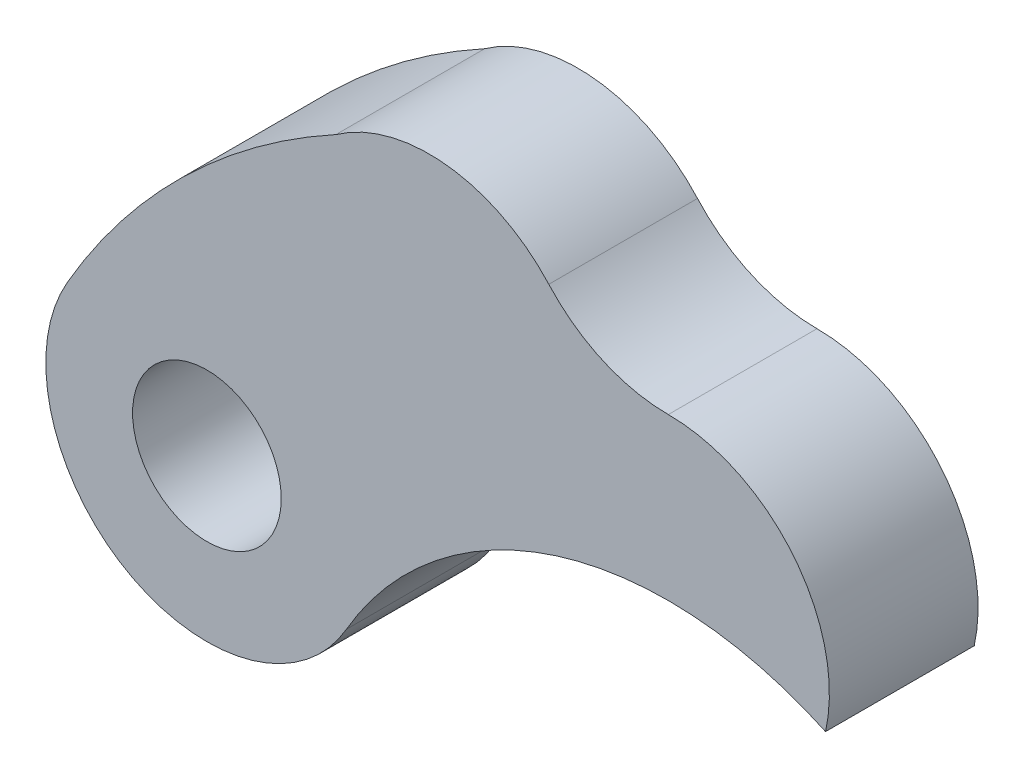
ISO-10303-21;
HEADER;
FILE_DESCRIPTION(('STEP AP214'),'2;1');
FILE_NAME('part.step','',(''),(''),'','','');
FILE_SCHEMA(('AUTOMOTIVE_DESIGN { 1 0 10303 214 1 1 1 1 }'));
ENDSEC;
DATA;
#1=APPLICATION_CONTEXT('core data for automotive mechanical design processes');
#2=APPLICATION_PROTOCOL_DEFINITION('international standard','automotive_design',2000,#1);
#3=PRODUCT_CONTEXT('',#1,'mechanical');
#4=PRODUCT('Part','Part','',(#3));
#5=PRODUCT_RELATED_PRODUCT_CATEGORY('part','',(#4));
#6=PRODUCT_DEFINITION_FORMATION('','',#4);
#7=PRODUCT_DEFINITION_CONTEXT('part definition',#1,'design');
#8=PRODUCT_DEFINITION('design','',#6,#7);
#9=PRODUCT_DEFINITION_SHAPE('','',#8);
#10=(LENGTH_UNIT() NAMED_UNIT(*) SI_UNIT(.MILLI.,.METRE.));
#11=(NAMED_UNIT(*) PLANE_ANGLE_UNIT() SI_UNIT($,.RADIAN.));
#12=(NAMED_UNIT(*) SI_UNIT($,.STERADIAN.) SOLID_ANGLE_UNIT());
#13=UNCERTAINTY_MEASURE_WITH_UNIT(LENGTH_MEASURE(1.E-05),#10,'distance_accuracy_value','');
#14=(GEOMETRIC_REPRESENTATION_CONTEXT(3) GLOBAL_UNCERTAINTY_ASSIGNED_CONTEXT((#13)) GLOBAL_UNIT_ASSIGNED_CONTEXT((#10,
#11,#12)) REPRESENTATION_CONTEXT('',''));
#15=CARTESIAN_POINT('',(0.,0.,0.));
#16=DIRECTION('',(0.,0.,1.));
#17=DIRECTION('',(1.,0.,0.));
#18=AXIS2_PLACEMENT_3D('',#15,#16,#17);
#19=CARTESIAN_POINT('',(-4.65488654534138,2.68749999999995,3.));
#20=DIRECTION('',(0.,0.,1.));
#21=DIRECTION('',(1.,0.,0.));
#22=AXIS2_PLACEMENT_3D('',#19,#20,#21);
#23=PLANE('',#22);
#24=CARTESIAN_POINT('',(0.,0.,3.));
#25=DIRECTION('',(0.,0.,-1.));
#26=DIRECTION('',(1.,0.,0.));
#27=AXIS2_PLACEMENT_3D('',#24,#25,#26);
#28=CIRCLE('',#27,7.5);
#29=CARTESIAN_POINT('',(-6.49519052838333,3.74999999999993,3.));
#30=VERTEX_POINT('',#29);
#31=CARTESIAN_POINT('',(3.17279833988153,6.79583333333337,3.));
#32=VERTEX_POINT('',#31);
#33=EDGE_CURVE('E129',#30,#32,#28,.T.);
#34=ORIENTED_EDGE('',*,*,#33,.T.);
#35=CARTESIAN_POINT('',(-1.02791498740459E-13,7.5,3.));
#36=DIRECTION('',(0.,0.,1.));
#37=DIRECTION('',(1.,0.,0.));
#38=AXIS2_PLACEMENT_3D('',#35,#36,#37);
#39=CIRCLE('',#38,3.25);
#40=CARTESIAN_POINT('',(8.25116963285393E-12,10.75,3.));
#41=VERTEX_POINT('',#40);
#42=EDGE_CURVE('E87',#32,#41,#39,.T.);
#43=ORIENTED_EDGE('',*,*,#42,.T.);
#44=CARTESIAN_POINT('',(1.07443616811178E-11,13.9999999999804,3.));
#45=DIRECTION('',(0.,0.,-1.));
#46=DIRECTION('',(1.,0.,0.));
#47=AXIS2_PLACEMENT_3D('',#44,#45,#46);
#48=CIRCLE('',#47,3.24999999998037);
#49=CARTESIAN_POINT('',(-2.41103489066175,11.8206857142858,3.));
#50=VERTEX_POINT('',#49);
#51=EDGE_CURVE('E100',#41,#50,#48,.T.);
#52=ORIENTED_EDGE('',*,*,#51,.T.);
#53=CARTESIAN_POINT('',(-4.8220697813488,9.64137142857813,3.));
#54=DIRECTION('',(0.,0.,1.));
#55=DIRECTION('',(1.,0.,0.));
#56=AXIS2_PLACEMENT_3D('',#53,#54,#55);
#57=CIRCLE('',#56,3.25);
#58=CARTESIAN_POINT('',(-6.70737151186564,12.288660114179,3.));
#59=VERTEX_POINT('',#58);
#60=EDGE_CURVE('E94',#50,#59,#57,.T.);
#61=ORIENTED_EDGE('',*,*,#60,.T.);
#62=CARTESIAN_POINT('',(0.,0.,3.));
#63=DIRECTION('',(0.,0.,1.));
#64=DIRECTION('',(1.,0.,0.));
#65=AXIS2_PLACEMENT_3D('',#62,#63,#64);
#66=CIRCLE('',#65,14.);
#67=CARTESIAN_POINT('',(-12.1243556529822,6.99999999999988,3.));
#68=VERTEX_POINT('',#67);
#69=EDGE_CURVE('E98',#59,#68,#66,.T.);
#70=ORIENTED_EDGE('',*,*,#69,.T.);
#71=CARTESIAN_POINT('',(-9.30977309068277,5.37499999999991,3.));
#72=DIRECTION('',(0.,0.,1.));
#73=DIRECTION('',(1.,0.,0.));
#74=AXIS2_PLACEMENT_3D('',#71,#72,#73);
#75=CIRCLE('',#74,3.25);
#76=EDGE_CURVE('E50',#68,#30,#75,.T.);
#77=ORIENTED_EDGE('',*,*,#76,.T.);
#78=EDGE_LOOP('',(#34,#43,#52,#61,#70,#77));
#79=FACE_BOUND('',#78,.T.);
#80=CARTESIAN_POINT('',(-9.30977309068277,5.37499999999991,3.));
#81=DIRECTION('',(0.,0.,1.));
#82=DIRECTION('',(1.,0.,0.));
#83=AXIS2_PLACEMENT_3D('',#80,#81,#82);
#84=CIRCLE('',#83,1.5);
#85=CARTESIAN_POINT('',(-7.80977309068277,5.37499999999991,3.));
#86=VERTEX_POINT('',#85);
#87=EDGE_CURVE('E122',#86,#86,#84,.T.);
#88=ORIENTED_EDGE('',*,*,#87,.F.);
#89=EDGE_LOOP('',(#88));
#90=FACE_BOUND('',#89,.T.);
#91=ADVANCED_FACE('F33',(#79,#90),#23,.T.);
#92=CARTESIAN_POINT('',(-4.65488654534138,2.68749999999995,0.));
#93=DIRECTION('',(0.,0.,1.));
#94=DIRECTION('',(1.,0.,0.));
#95=AXIS2_PLACEMENT_3D('',#92,#93,#94);
#96=PLANE('',#95);
#97=CARTESIAN_POINT('',(0.,0.,0.));
#98=DIRECTION('',(0.,0.,-1.));
#99=DIRECTION('',(1.,0.,0.));
#100=AXIS2_PLACEMENT_3D('',#97,#98,#99);
#101=CIRCLE('',#100,7.5);
#102=CARTESIAN_POINT('',(-6.49519052838333,3.74999999999993,0.));
#103=VERTEX_POINT('',#102);
#104=CARTESIAN_POINT('',(3.17279833988153,6.79583333333337,0.));
#105=VERTEX_POINT('',#104);
#106=EDGE_CURVE('E118',#103,#105,#101,.T.);
#107=ORIENTED_EDGE('',*,*,#106,.F.);
#108=CARTESIAN_POINT('',(-9.30977309068277,5.37499999999991,0.));
#109=DIRECTION('',(0.,0.,1.));
#110=DIRECTION('',(1.,0.,0.));
#111=AXIS2_PLACEMENT_3D('',#108,#109,#110);
#112=CIRCLE('',#111,3.25);
#113=CARTESIAN_POINT('',(-12.1243556529822,6.99999999999988,0.));
#114=VERTEX_POINT('',#113);
#115=EDGE_CURVE('E79',#114,#103,#112,.T.);
#116=ORIENTED_EDGE('',*,*,#115,.F.);
#117=CARTESIAN_POINT('',(0.,0.,0.));
#118=DIRECTION('',(0.,0.,1.));
#119=DIRECTION('',(1.,0.,0.));
#120=AXIS2_PLACEMENT_3D('',#117,#118,#119);
#121=CIRCLE('',#120,14.);
#122=CARTESIAN_POINT('',(-6.70737151186564,12.288660114179,0.));
#123=VERTEX_POINT('',#122);
#124=EDGE_CURVE('E73',#123,#114,#121,.T.);
#125=ORIENTED_EDGE('',*,*,#124,.F.);
#126=CARTESIAN_POINT('',(-4.8220697813488,9.64137142857813,0.));
#127=DIRECTION('',(0.,0.,1.));
#128=DIRECTION('',(1.,0.,0.));
#129=AXIS2_PLACEMENT_3D('',#126,#127,#128);
#130=CIRCLE('',#129,3.25);
#131=CARTESIAN_POINT('',(-2.41103489066175,11.8206857142858,0.));
#132=VERTEX_POINT('',#131);
#133=EDGE_CURVE('E108',#132,#123,#130,.T.);
#134=ORIENTED_EDGE('',*,*,#133,.F.);
#135=CARTESIAN_POINT('',(1.07443616811178E-11,13.9999999999804,0.));
#136=DIRECTION('',(0.,0.,-1.));
#137=DIRECTION('',(1.,0.,0.));
#138=AXIS2_PLACEMENT_3D('',#135,#136,#137);
#139=CIRCLE('',#138,3.24999999998037);
#140=CARTESIAN_POINT('',(8.25116963285393E-12,10.75,0.));
#141=VERTEX_POINT('',#140);
#142=EDGE_CURVE('E124',#141,#132,#139,.T.);
#143=ORIENTED_EDGE('',*,*,#142,.F.);
#144=CARTESIAN_POINT('',(-1.02791498740459E-13,7.5,0.));
#145=DIRECTION('',(0.,0.,1.));
#146=DIRECTION('',(1.,0.,0.));
#147=AXIS2_PLACEMENT_3D('',#144,#145,#146);
#148=CIRCLE('',#147,3.25);
#149=EDGE_CURVE('E121',#105,#141,#148,.T.);
#150=ORIENTED_EDGE('',*,*,#149,.F.);
#151=EDGE_LOOP('',(#107,#116,#125,#134,#143,#150));
#152=FACE_BOUND('',#151,.T.);
#153=CARTESIAN_POINT('',(-9.30977309068277,5.37499999999991,0.));
#154=DIRECTION('',(0.,0.,1.));
#155=DIRECTION('',(1.,0.,0.));
#156=AXIS2_PLACEMENT_3D('',#153,#154,#155);
#157=CIRCLE('',#156,1.5);
#158=CARTESIAN_POINT('',(-7.80977309068277,5.37499999999991,0.));
#159=VERTEX_POINT('',#158);
#160=EDGE_CURVE('E222',#159,#159,#157,.T.);
#161=ORIENTED_EDGE('',*,*,#160,.T.);
#162=EDGE_LOOP('',(#161));
#163=FACE_BOUND('',#162,.T.);
#164=ADVANCED_FACE('F138',(#152,#163),#96,.F.);
#165=CARTESIAN_POINT('',(0.,0.,3.));
#166=DIRECTION('',(0.,0.,-1.));
#167=DIRECTION('',(-1.,0.,0.));
#168=AXIS2_PLACEMENT_3D('',#165,#166,#167);
#169=CYLINDRICAL_SURFACE('',#168,7.5);
#170=ORIENTED_EDGE('',*,*,#106,.T.);
#171=DIRECTION('',(0.,0.,-1.));
#172=VECTOR('',#171,1.);
#173=CARTESIAN_POINT('',(3.17279833988153,6.79583333333337,3.));
#174=LINE('',#173,#172);
#175=EDGE_CURVE('E11',#32,#105,#174,.T.);
#176=ORIENTED_EDGE('',*,*,#175,.F.);
#177=ORIENTED_EDGE('',*,*,#33,.F.);
#178=DIRECTION('',(0.,0.,-1.));
#179=VECTOR('',#178,1.);
#180=CARTESIAN_POINT('',(-6.49519052838333,3.74999999999993,3.));
#181=LINE('',#180,#179);
#182=EDGE_CURVE('E114',#30,#103,#181,.T.);
#183=ORIENTED_EDGE('',*,*,#182,.T.);
#184=EDGE_LOOP('',(#170,#176,#177,#183));
#185=FACE_BOUND('',#184,.T.);
#186=ADVANCED_FACE('F35',(#185),#169,.F.);
#187=CARTESIAN_POINT('',(-1.02791498740459E-13,7.5,3.));
#188=DIRECTION('',(0.,0.,-1.));
#189=DIRECTION('',(-1.,0.,0.));
#190=AXIS2_PLACEMENT_3D('',#187,#188,#189);
#191=CYLINDRICAL_SURFACE('',#190,3.25);
#192=ORIENTED_EDGE('',*,*,#149,.T.);
#193=DIRECTION('',(0.,0.,-1.));
#194=VECTOR('',#193,1.);
#195=CARTESIAN_POINT('',(8.25116963285393E-12,10.75,3.));
#196=LINE('',#195,#194);
#197=EDGE_CURVE('E42',#41,#141,#196,.T.);
#198=ORIENTED_EDGE('',*,*,#197,.F.);
#199=ORIENTED_EDGE('',*,*,#42,.F.);
#200=ORIENTED_EDGE('',*,*,#175,.T.);
#201=EDGE_LOOP('',(#192,#198,#199,#200));
#202=FACE_BOUND('',#201,.T.);
#203=ADVANCED_FACE('F163',(#202),#191,.T.);
#204=CARTESIAN_POINT('',(1.07443616811178E-11,13.9999999999804,3.));
#205=DIRECTION('',(0.,0.,-1.));
#206=DIRECTION('',(-1.,0.,0.));
#207=AXIS2_PLACEMENT_3D('',#204,#205,#206);
#208=CYLINDRICAL_SURFACE('',#207,3.24999999998037);
#209=ORIENTED_EDGE('',*,*,#142,.T.);
#210=DIRECTION('',(0.,0.,-1.));
#211=VECTOR('',#210,1.);
#212=CARTESIAN_POINT('',(-2.41103489066175,11.8206857142858,3.));
#213=LINE('',#212,#211);
#214=EDGE_CURVE('E109',#50,#132,#213,.T.);
#215=ORIENTED_EDGE('',*,*,#214,.F.);
#216=ORIENTED_EDGE('',*,*,#51,.F.);
#217=ORIENTED_EDGE('',*,*,#197,.T.);
#218=EDGE_LOOP('',(#209,#215,#216,#217));
#219=FACE_BOUND('',#218,.T.);
#220=ADVANCED_FACE('F135',(#219),#208,.F.);
#221=CARTESIAN_POINT('',(-4.8220697813488,9.64137142857813,3.));
#222=DIRECTION('',(0.,0.,-1.));
#223=DIRECTION('',(-1.,0.,0.));
#224=AXIS2_PLACEMENT_3D('',#221,#222,#223);
#225=CYLINDRICAL_SURFACE('',#224,3.25);
#226=ORIENTED_EDGE('',*,*,#133,.T.);
#227=DIRECTION('',(0.,0.,-1.));
#228=VECTOR('',#227,1.);
#229=CARTESIAN_POINT('',(-6.70737151186564,12.288660114179,3.));
#230=LINE('',#229,#228);
#231=EDGE_CURVE('E105',#59,#123,#230,.T.);
#232=ORIENTED_EDGE('',*,*,#231,.F.);
#233=ORIENTED_EDGE('',*,*,#60,.F.);
#234=ORIENTED_EDGE('',*,*,#214,.T.);
#235=EDGE_LOOP('',(#226,#232,#233,#234));
#236=FACE_BOUND('',#235,.T.);
#237=ADVANCED_FACE('F106',(#236),#225,.T.);
#238=CARTESIAN_POINT('',(0.,0.,3.));
#239=DIRECTION('',(0.,0.,-1.));
#240=DIRECTION('',(-1.,0.,0.));
#241=AXIS2_PLACEMENT_3D('',#238,#239,#240);
#242=CYLINDRICAL_SURFACE('',#241,14.);
#243=ORIENTED_EDGE('',*,*,#124,.T.);
#244=DIRECTION('',(0.,0.,-1.));
#245=VECTOR('',#244,1.);
#246=CARTESIAN_POINT('',(-12.1243556529822,6.99999999999988,3.));
#247=LINE('',#246,#245);
#248=EDGE_CURVE('E110',#68,#114,#247,.T.);
#249=ORIENTED_EDGE('',*,*,#248,.F.);
#250=ORIENTED_EDGE('',*,*,#69,.F.);
#251=ORIENTED_EDGE('',*,*,#231,.T.);
#252=EDGE_LOOP('',(#243,#249,#250,#251));
#253=FACE_BOUND('',#252,.T.);
#254=ADVANCED_FACE('F112',(#253),#242,.T.);
#255=CARTESIAN_POINT('',(-9.30977309068277,5.37499999999991,3.));
#256=DIRECTION('',(0.,0.,-1.));
#257=DIRECTION('',(-1.,0.,0.));
#258=AXIS2_PLACEMENT_3D('',#255,#256,#257);
#259=CYLINDRICAL_SURFACE('',#258,3.25);
#260=ORIENTED_EDGE('',*,*,#115,.T.);
#261=ORIENTED_EDGE('',*,*,#182,.F.);
#262=ORIENTED_EDGE('',*,*,#76,.F.);
#263=ORIENTED_EDGE('',*,*,#248,.T.);
#264=EDGE_LOOP('',(#260,#261,#262,#263));
#265=FACE_BOUND('',#264,.T.);
#266=ADVANCED_FACE('F143',(#265),#259,.T.);
#267=CARTESIAN_POINT('',(-9.30977309068277,5.37499999999991,3.));
#268=DIRECTION('',(0.,0.,-1.));
#269=DIRECTION('',(-1.,0.,0.));
#270=AXIS2_PLACEMENT_3D('',#267,#268,#269);
#271=CYLINDRICAL_SURFACE('',#270,1.5);
#272=ORIENTED_EDGE('',*,*,#87,.T.);
#273=EDGE_LOOP('',(#272));
#274=FACE_BOUND('',#273,.T.);
#275=ORIENTED_EDGE('',*,*,#160,.F.);
#276=EDGE_LOOP('',(#275));
#277=FACE_BOUND('',#276,.T.);
#278=ADVANCED_FACE('F145',(#274,#277),#271,.F.);
#279=CLOSED_SHELL('',(#91,#164,#186,#203,#220,#237,#254,#266,#278));
#280=MANIFOLD_SOLID_BREP('B2',#279);
#281=ADVANCED_BREP_SHAPE_REPRESENTATION('',(#18,#280),#14);
#282=SHAPE_DEFINITION_REPRESENTATION(#9,#281);
ENDSEC;
END-ISO-10303-21;
